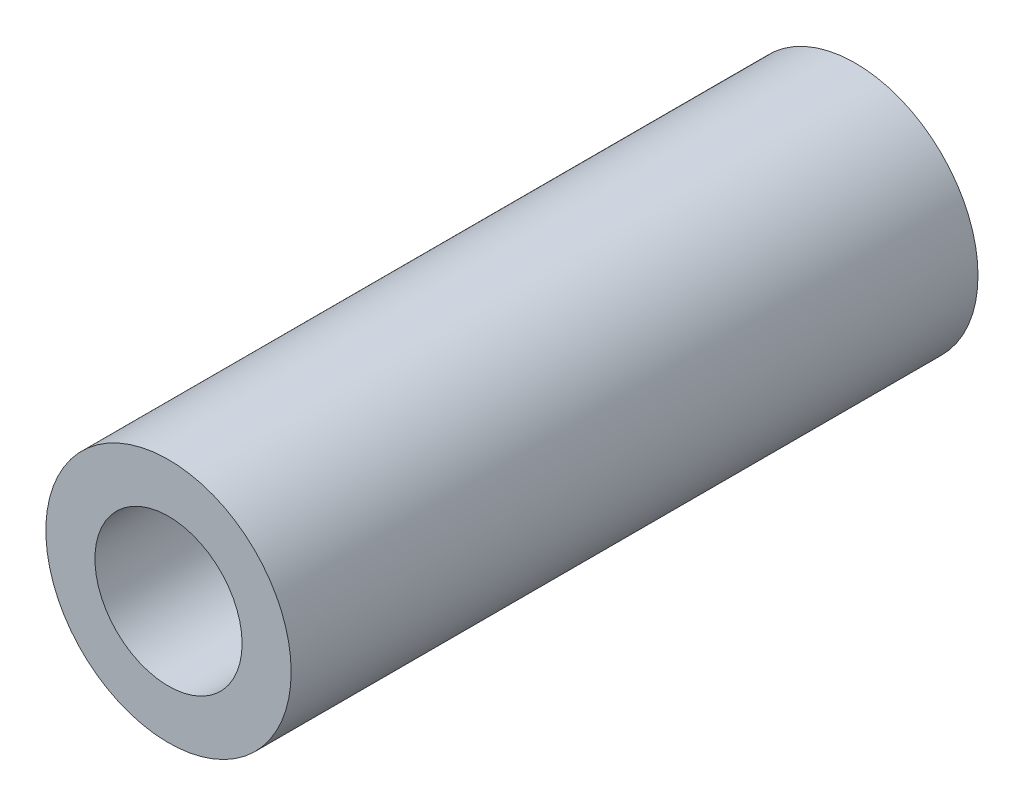
ISO-10303-21;
HEADER;
FILE_DESCRIPTION(('STEP AP214'),'2;1');
FILE_NAME('part.step','',(''),(''),'','','');
FILE_SCHEMA(('AUTOMOTIVE_DESIGN { 1 0 10303 214 1 1 1 1 }'));
ENDSEC;
DATA;
#1=APPLICATION_CONTEXT('core data for automotive mechanical design processes');
#2=APPLICATION_PROTOCOL_DEFINITION('international standard','automotive_design',2000,#1);
#3=PRODUCT_CONTEXT('',#1,'mechanical');
#4=PRODUCT('Part','Part','',(#3));
#5=PRODUCT_RELATED_PRODUCT_CATEGORY('part','',(#4));
#6=PRODUCT_DEFINITION_FORMATION('','',#4);
#7=PRODUCT_DEFINITION_CONTEXT('part definition',#1,'design');
#8=PRODUCT_DEFINITION('design','',#6,#7);
#9=PRODUCT_DEFINITION_SHAPE('','',#8);
#10=(LENGTH_UNIT() NAMED_UNIT(*) SI_UNIT(.MILLI.,.METRE.));
#11=(NAMED_UNIT(*) PLANE_ANGLE_UNIT() SI_UNIT($,.RADIAN.));
#12=(NAMED_UNIT(*) SI_UNIT($,.STERADIAN.) SOLID_ANGLE_UNIT());
#13=UNCERTAINTY_MEASURE_WITH_UNIT(LENGTH_MEASURE(1.E-05),#10,'distance_accuracy_value','');
#14=(GEOMETRIC_REPRESENTATION_CONTEXT(3) GLOBAL_UNCERTAINTY_ASSIGNED_CONTEXT((#13)) GLOBAL_UNIT_ASSIGNED_CONTEXT((#10,
#11,#12)) REPRESENTATION_CONTEXT('',''));
#15=CARTESIAN_POINT('',(0.,0.,0.));
#16=DIRECTION('',(0.,0.,1.));
#17=DIRECTION('',(1.,0.,0.));
#18=AXIS2_PLACEMENT_3D('',#15,#16,#17);
#19=CARTESIAN_POINT('',(0.,0.,14.));
#20=DIRECTION('',(0.,0.,1.));
#21=DIRECTION('',(1.,0.,0.));
#22=AXIS2_PLACEMENT_3D('',#19,#20,#21);
#23=PLANE('',#22);
#24=CARTESIAN_POINT('',(0.,0.,14.));
#25=DIRECTION('',(0.,0.,1.));
#26=DIRECTION('',(1.,0.,0.));
#27=AXIS2_PLACEMENT_3D('',#24,#25,#26);
#28=CIRCLE('',#27,2.5);
#29=CARTESIAN_POINT('',(2.5,0.,14.));
#30=VERTEX_POINT('',#29);
#31=EDGE_CURVE('E10',#30,#30,#28,.T.);
#32=ORIENTED_EDGE('',*,*,#31,.T.);
#33=EDGE_LOOP('',(#32));
#34=FACE_BOUND('',#33,.T.);
#35=CARTESIAN_POINT('',(0.,0.,14.));
#36=DIRECTION('',(0.,0.,1.));
#37=DIRECTION('',(1.,0.,0.));
#38=AXIS2_PLACEMENT_3D('',#35,#36,#37);
#39=CIRCLE('',#38,1.5);
#40=CARTESIAN_POINT('',(1.5,0.,14.));
#41=VERTEX_POINT('',#40);
#42=EDGE_CURVE('E46',#41,#41,#39,.T.);
#43=ORIENTED_EDGE('',*,*,#42,.F.);
#44=EDGE_LOOP('',(#43));
#45=FACE_BOUND('',#44,.T.);
#46=ADVANCED_FACE('F35',(#34,#45),#23,.T.);
#47=CARTESIAN_POINT('',(0.,0.,0.));
#48=DIRECTION('',(0.,0.,1.));
#49=DIRECTION('',(1.,0.,0.));
#50=AXIS2_PLACEMENT_3D('',#47,#48,#49);
#51=PLANE('',#50);
#52=CARTESIAN_POINT('',(0.,0.,0.));
#53=DIRECTION('',(0.,0.,1.));
#54=DIRECTION('',(1.,0.,0.));
#55=AXIS2_PLACEMENT_3D('',#52,#53,#54);
#56=CIRCLE('',#55,2.5);
#57=CARTESIAN_POINT('',(2.5,0.,0.));
#58=VERTEX_POINT('',#57);
#59=EDGE_CURVE('E39',#58,#58,#56,.T.);
#60=ORIENTED_EDGE('',*,*,#59,.F.);
#61=EDGE_LOOP('',(#60));
#62=FACE_BOUND('',#61,.T.);
#63=CARTESIAN_POINT('',(0.,0.,0.));
#64=DIRECTION('',(0.,0.,1.));
#65=DIRECTION('',(1.,0.,0.));
#66=AXIS2_PLACEMENT_3D('',#63,#64,#65);
#67=CIRCLE('',#66,1.5);
#68=CARTESIAN_POINT('',(1.5,0.,0.));
#69=VERTEX_POINT('',#68);
#70=EDGE_CURVE('E48',#69,#69,#67,.T.);
#71=ORIENTED_EDGE('',*,*,#70,.T.);
#72=EDGE_LOOP('',(#71));
#73=FACE_BOUND('',#72,.T.);
#74=ADVANCED_FACE('F58',(#62,#73),#51,.F.);
#75=CARTESIAN_POINT('',(0.,0.,14.));
#76=DIRECTION('',(0.,0.,-1.));
#77=DIRECTION('',(-1.,0.,0.));
#78=AXIS2_PLACEMENT_3D('',#75,#76,#77);
#79=CYLINDRICAL_SURFACE('',#78,2.5);
#80=ORIENTED_EDGE('',*,*,#31,.F.);
#81=EDGE_LOOP('',(#80));
#82=FACE_BOUND('',#81,.T.);
#83=ORIENTED_EDGE('',*,*,#59,.T.);
#84=EDGE_LOOP('',(#83));
#85=FACE_BOUND('',#84,.T.);
#86=ADVANCED_FACE('F37',(#82,#85),#79,.T.);
#87=CARTESIAN_POINT('',(0.,0.,14.));
#88=DIRECTION('',(0.,0.,-1.));
#89=DIRECTION('',(-1.,0.,0.));
#90=AXIS2_PLACEMENT_3D('',#87,#88,#89);
#91=CYLINDRICAL_SURFACE('',#90,1.5);
#92=ORIENTED_EDGE('',*,*,#42,.T.);
#93=EDGE_LOOP('',(#92));
#94=FACE_BOUND('',#93,.T.);
#95=ORIENTED_EDGE('',*,*,#70,.F.);
#96=EDGE_LOOP('',(#95));
#97=FACE_BOUND('',#96,.T.);
#98=ADVANCED_FACE('F54',(#94,#97),#91,.F.);
#99=CLOSED_SHELL('',(#46,#74,#86,#98));
#100=MANIFOLD_SOLID_BREP('B2',#99);
#101=ADVANCED_BREP_SHAPE_REPRESENTATION('',(#18,#100),#14);
#102=SHAPE_DEFINITION_REPRESENTATION(#9,#101);
ENDSEC;
END-ISO-10303-21;
